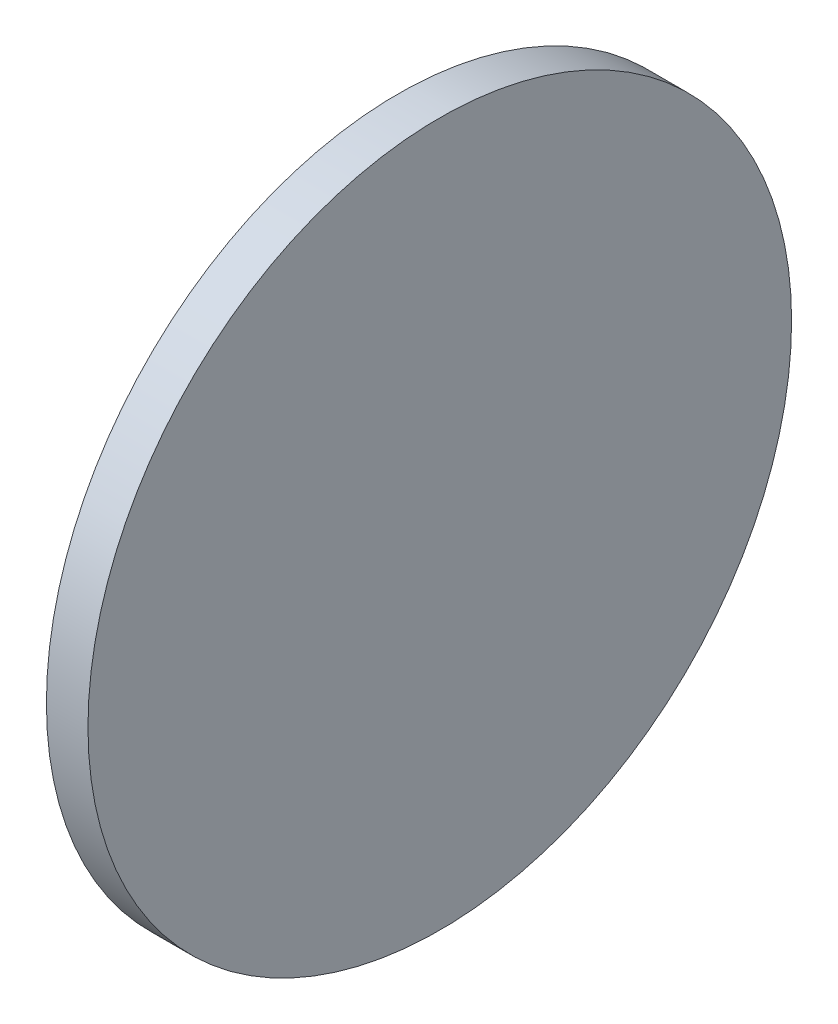
ISO-10303-21;
HEADER;
FILE_DESCRIPTION(('STEP AP214'),'2;1');
FILE_NAME('part.step','',(''),(''),'','','');
FILE_SCHEMA(('AUTOMOTIVE_DESIGN { 1 0 10303 214 1 1 1 1 }'));
ENDSEC;
DATA;
#1=APPLICATION_CONTEXT('core data for automotive mechanical design processes');
#2=APPLICATION_PROTOCOL_DEFINITION('international standard','automotive_design',2000,#1);
#3=PRODUCT_CONTEXT('',#1,'mechanical');
#4=PRODUCT('Part','Part','',(#3));
#5=PRODUCT_RELATED_PRODUCT_CATEGORY('part','',(#4));
#6=PRODUCT_DEFINITION_FORMATION('','',#4);
#7=PRODUCT_DEFINITION_CONTEXT('part definition',#1,'design');
#8=PRODUCT_DEFINITION('design','',#6,#7);
#9=PRODUCT_DEFINITION_SHAPE('','',#8);
#10=(LENGTH_UNIT() NAMED_UNIT(*) SI_UNIT(.MILLI.,.METRE.));
#11=(NAMED_UNIT(*) PLANE_ANGLE_UNIT() SI_UNIT($,.RADIAN.));
#12=(NAMED_UNIT(*) SI_UNIT($,.STERADIAN.) SOLID_ANGLE_UNIT());
#13=UNCERTAINTY_MEASURE_WITH_UNIT(LENGTH_MEASURE(1.E-05),#10,'distance_accuracy_value','');
#14=(GEOMETRIC_REPRESENTATION_CONTEXT(3) GLOBAL_UNCERTAINTY_ASSIGNED_CONTEXT((#13)) GLOBAL_UNIT_ASSIGNED_CONTEXT((#10,
#11,#12)) REPRESENTATION_CONTEXT('',''));
#15=CARTESIAN_POINT('',(0.,0.,0.));
#16=DIRECTION('',(0.,0.,1.));
#17=DIRECTION('',(1.,0.,0.));
#18=AXIS2_PLACEMENT_3D('',#15,#16,#17);
#19=CARTESIAN_POINT('',(0.,0.,0.));
#20=DIRECTION('',(-1.,0.,0.));
#21=DIRECTION('',(0.,0.,1.));
#22=AXIS2_PLACEMENT_3D('',#19,#20,#21);
#23=CYLINDRICAL_SURFACE('',#22,25.4);
#24=CARTESIAN_POINT('',(0.,0.,0.));
#25=DIRECTION('',(-1.,0.,0.));
#26=DIRECTION('',(0.,0.,1.));
#27=AXIS2_PLACEMENT_3D('',#24,#25,#26);
#28=CIRCLE('',#27,25.4);
#29=CARTESIAN_POINT('',(0.,0.,25.4));
#30=VERTEX_POINT('',#29);
#31=EDGE_CURVE('E44',#30,#30,#28,.T.);
#32=ORIENTED_EDGE('',*,*,#31,.F.);
#33=EDGE_LOOP('',(#32));
#34=FACE_BOUND('',#33,.T.);
#35=CARTESIAN_POINT('',(3.,0.,0.));
#36=DIRECTION('',(-1.,0.,0.));
#37=DIRECTION('',(0.,0.,1.));
#38=AXIS2_PLACEMENT_3D('',#35,#36,#37);
#39=CIRCLE('',#38,25.4);
#40=CARTESIAN_POINT('',(3.,0.,25.4));
#41=VERTEX_POINT('',#40);
#42=EDGE_CURVE('E10',#41,#41,#39,.T.);
#43=ORIENTED_EDGE('',*,*,#42,.T.);
#44=EDGE_LOOP('',(#43));
#45=FACE_BOUND('',#44,.T.);
#46=ADVANCED_FACE('F37',(#34,#45),#23,.T.);
#47=CARTESIAN_POINT('',(3.,25.4,0.));
#48=DIRECTION('',(-1.,0.,0.));
#49=DIRECTION('',(0.,0.,1.));
#50=AXIS2_PLACEMENT_3D('',#47,#48,#49);
#51=PLANE('',#50);
#52=ORIENTED_EDGE('',*,*,#42,.F.);
#53=EDGE_LOOP('',(#52));
#54=FACE_BOUND('',#53,.T.);
#55=ADVANCED_FACE('F54',(#54),#51,.F.);
#56=CARTESIAN_POINT('',(0.,25.4,0.));
#57=DIRECTION('',(1.,0.,0.));
#58=DIRECTION('',(0.,0.,-1.));
#59=AXIS2_PLACEMENT_3D('',#56,#57,#58);
#60=PLANE('',#59);
#61=ORIENTED_EDGE('',*,*,#31,.T.);
#62=EDGE_LOOP('',(#61));
#63=FACE_BOUND('',#62,.T.);
#64=ADVANCED_FACE('F51',(#63),#60,.F.);
#65=CLOSED_SHELL('',(#46,#55,#64));
#66=MANIFOLD_SOLID_BREP('B2',#65);
#67=ADVANCED_BREP_SHAPE_REPRESENTATION('',(#18,#66),#14);
#68=SHAPE_DEFINITION_REPRESENTATION(#9,#67);
ENDSEC;
END-ISO-10303-21;
